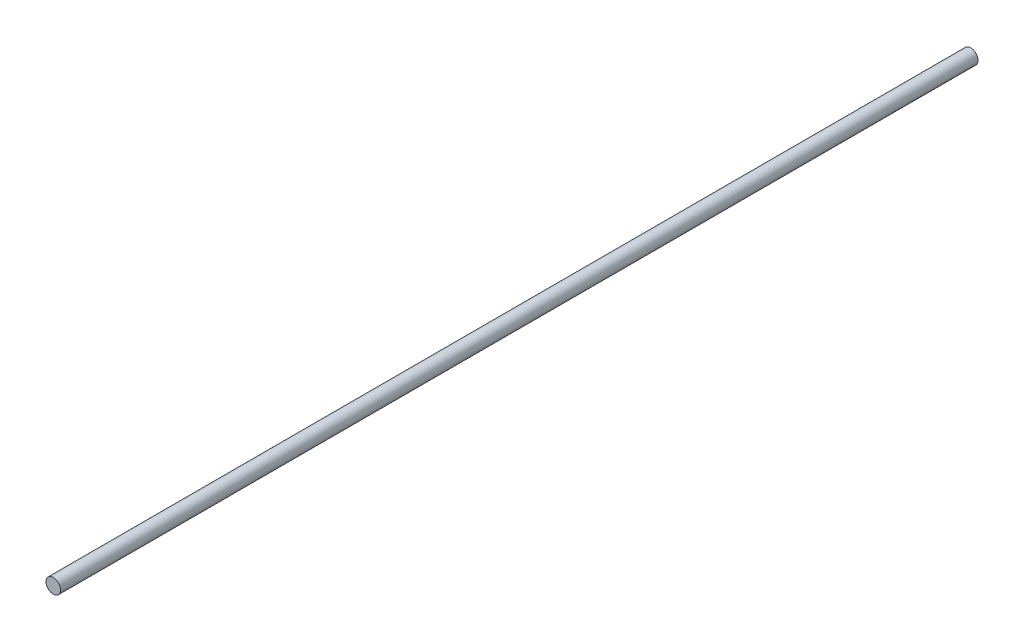
ISO-10303-21;
HEADER;
FILE_DESCRIPTION(('STEP AP214'),'2;1');
FILE_NAME('part.step','',(''),(''),'','','');
FILE_SCHEMA(('AUTOMOTIVE_DESIGN { 1 0 10303 214 1 1 1 1 }'));
ENDSEC;
DATA;
#1=APPLICATION_CONTEXT('core data for automotive mechanical design processes');
#2=APPLICATION_PROTOCOL_DEFINITION('international standard','automotive_design',2000,#1);
#3=PRODUCT_CONTEXT('',#1,'mechanical');
#4=PRODUCT('Part','Part','',(#3));
#5=PRODUCT_RELATED_PRODUCT_CATEGORY('part','',(#4));
#6=PRODUCT_DEFINITION_FORMATION('','',#4);
#7=PRODUCT_DEFINITION_CONTEXT('part definition',#1,'design');
#8=PRODUCT_DEFINITION('design','',#6,#7);
#9=PRODUCT_DEFINITION_SHAPE('','',#8);
#10=(LENGTH_UNIT() NAMED_UNIT(*) SI_UNIT(.MILLI.,.METRE.));
#11=(NAMED_UNIT(*) PLANE_ANGLE_UNIT() SI_UNIT($,.RADIAN.));
#12=(NAMED_UNIT(*) SI_UNIT($,.STERADIAN.) SOLID_ANGLE_UNIT());
#13=UNCERTAINTY_MEASURE_WITH_UNIT(LENGTH_MEASURE(1.E-05),#10,'distance_accuracy_value','');
#14=(GEOMETRIC_REPRESENTATION_CONTEXT(3) GLOBAL_UNCERTAINTY_ASSIGNED_CONTEXT((#13)) GLOBAL_UNIT_ASSIGNED_CONTEXT((#10,
#11,#12)) REPRESENTATION_CONTEXT('',''));
#15=CARTESIAN_POINT('',(0.,0.,0.));
#16=DIRECTION('',(0.,0.,1.));
#17=DIRECTION('',(1.,0.,0.));
#18=AXIS2_PLACEMENT_3D('',#15,#16,#17);
#19=CARTESIAN_POINT('',(0.,0.,-800.));
#20=DIRECTION('',(0.,0.,1.));
#21=DIRECTION('',(1.,0.,0.));
#22=AXIS2_PLACEMENT_3D('',#19,#20,#21);
#23=CYLINDRICAL_SURFACE('',#22,6.35);
#24=CARTESIAN_POINT('',(0.,0.,-800.));
#25=DIRECTION('',(0.,0.,1.));
#26=DIRECTION('',(1.,0.,0.));
#27=AXIS2_PLACEMENT_3D('',#24,#25,#26);
#28=CIRCLE('',#27,6.35);
#29=CARTESIAN_POINT('',(6.35,0.,-800.));
#30=VERTEX_POINT('',#29);
#31=EDGE_CURVE('E10',#30,#30,#28,.T.);
#32=ORIENTED_EDGE('',*,*,#31,.T.);
#33=EDGE_LOOP('',(#32));
#34=FACE_BOUND('',#33,.T.);
#35=CARTESIAN_POINT('',(0.,0.,0.));
#36=DIRECTION('',(0.,0.,1.));
#37=DIRECTION('',(1.,0.,0.));
#38=AXIS2_PLACEMENT_3D('',#35,#36,#37);
#39=CIRCLE('',#38,6.35);
#40=CARTESIAN_POINT('',(6.35,0.,0.));
#41=VERTEX_POINT('',#40);
#42=EDGE_CURVE('E34',#41,#41,#39,.T.);
#43=ORIENTED_EDGE('',*,*,#42,.F.);
#44=EDGE_LOOP('',(#43));
#45=FACE_BOUND('',#44,.T.);
#46=ADVANCED_FACE('F31',(#34,#45),#23,.T.);
#47=CARTESIAN_POINT('',(0.,0.,-800.));
#48=DIRECTION('',(0.,0.,1.));
#49=DIRECTION('',(1.,0.,0.));
#50=AXIS2_PLACEMENT_3D('',#47,#48,#49);
#51=PLANE('',#50);
#52=ORIENTED_EDGE('',*,*,#31,.F.);
#53=EDGE_LOOP('',(#52));
#54=FACE_BOUND('',#53,.T.);
#55=ADVANCED_FACE('F46',(#54),#51,.F.);
#56=CARTESIAN_POINT('',(0.,0.,0.));
#57=DIRECTION('',(0.,0.,1.));
#58=DIRECTION('',(1.,0.,0.));
#59=AXIS2_PLACEMENT_3D('',#56,#57,#58);
#60=PLANE('',#59);
#61=ORIENTED_EDGE('',*,*,#42,.T.);
#62=EDGE_LOOP('',(#61));
#63=FACE_BOUND('',#62,.T.);
#64=ADVANCED_FACE('F43',(#63),#60,.T.);
#65=CLOSED_SHELL('',(#46,#55,#64));
#66=MANIFOLD_SOLID_BREP('B2',#65);
#67=ADVANCED_BREP_SHAPE_REPRESENTATION('',(#18,#66),#14);
#68=SHAPE_DEFINITION_REPRESENTATION(#9,#67);
ENDSEC;
END-ISO-10303-21;
